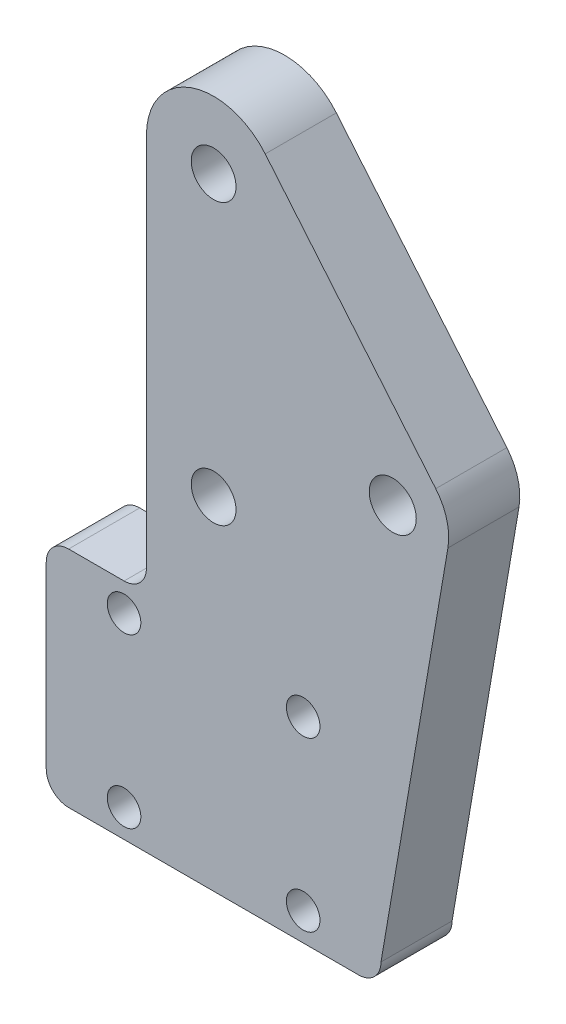
ISO-10303-21;
HEADER;
FILE_DESCRIPTION(('STEP AP214'),'2;1');
FILE_NAME('part.step','',(''),(''),'','','');
FILE_SCHEMA(('AUTOMOTIVE_DESIGN { 1 0 10303 214 1 1 1 1 }'));
ENDSEC;
DATA;
#1=APPLICATION_CONTEXT('core data for automotive mechanical design processes');
#2=APPLICATION_PROTOCOL_DEFINITION('international standard','automotive_design',2000,#1);
#3=PRODUCT_CONTEXT('',#1,'mechanical');
#4=PRODUCT('Part','Part','',(#3));
#5=PRODUCT_RELATED_PRODUCT_CATEGORY('part','',(#4));
#6=PRODUCT_DEFINITION_FORMATION('','',#4);
#7=PRODUCT_DEFINITION_CONTEXT('part definition',#1,'design');
#8=PRODUCT_DEFINITION('design','',#6,#7);
#9=PRODUCT_DEFINITION_SHAPE('','',#8);
#10=(LENGTH_UNIT() NAMED_UNIT(*) SI_UNIT(.MILLI.,.METRE.));
#11=(NAMED_UNIT(*) PLANE_ANGLE_UNIT() SI_UNIT($,.RADIAN.));
#12=(NAMED_UNIT(*) SI_UNIT($,.STERADIAN.) SOLID_ANGLE_UNIT());
#13=UNCERTAINTY_MEASURE_WITH_UNIT(LENGTH_MEASURE(1.E-05),#10,'distance_accuracy_value','');
#14=(GEOMETRIC_REPRESENTATION_CONTEXT(3) GLOBAL_UNCERTAINTY_ASSIGNED_CONTEXT((#13)) GLOBAL_UNIT_ASSIGNED_CONTEXT((#10,
#11,#12)) REPRESENTATION_CONTEXT('',''));
#15=CARTESIAN_POINT('',(0.,0.,0.));
#16=DIRECTION('',(0.,0.,1.));
#17=DIRECTION('',(1.,0.,0.));
#18=AXIS2_PLACEMENT_3D('',#15,#16,#17);
#19=CARTESIAN_POINT('',(19.9500000000002,45.4999959998346,6.35));
#20=DIRECTION('',(0.,0.,1.));
#21=DIRECTION('',(1.,0.,0.));
#22=AXIS2_PLACEMENT_3D('',#19,#20,#21);
#23=PLANE('',#22);
#24=DIRECTION('',(-0.640142111431928,0.768256517819063,0.));
#25=VECTOR('',#24,1.);
#26=CARTESIAN_POINT('',(24.5595391069245,49.3408486684344,6.35));
#27=LINE('',#26,#25);
#28=CARTESIAN_POINT('',(39.7912825890956,31.0607105569921,6.35));
#29=VERTEX_POINT('',#28);
#30=CARTESIAN_POINT('',(24.5595391069245,49.3408486684344,6.35));
#31=VERTEX_POINT('',#30);
#32=EDGE_CURVE('E131',#29,#31,#27,.T.);
#33=ORIENTED_EDGE('',*,*,#32,.T.);
#34=CARTESIAN_POINT('',(19.9500000000002,45.4999959998346,6.35));
#35=DIRECTION('',(0.,0.,1.));
#36=DIRECTION('',(1.,0.,0.));
#37=AXIS2_PLACEMENT_3D('',#34,#35,#36);
#38=CIRCLE('',#37,6.00000000001292);
#39=CARTESIAN_POINT('',(13.9499999999898,45.4999959998347,6.35));
#40=VERTEX_POINT('',#39);
#41=EDGE_CURVE('E48',#31,#40,#38,.T.);
#42=ORIENTED_EDGE('',*,*,#41,.T.);
#43=DIRECTION('',(0.,-1.,0.));
#44=VECTOR('',#43,1.);
#45=CARTESIAN_POINT('',(13.9499999999898,45.4999959998347,6.35));
#46=LINE('',#45,#44);
#47=CARTESIAN_POINT('',(13.949999999989,11.9999959998324,6.35));
#48=VERTEX_POINT('',#47);
#49=EDGE_CURVE('E203',#40,#48,#46,.T.);
#50=ORIENTED_EDGE('',*,*,#49,.T.);
#51=CARTESIAN_POINT('',(11.949999999989,11.9999959998325,6.35));
#52=DIRECTION('',(0.,0.,1.));
#53=DIRECTION('',(1.,0.,0.));
#54=AXIS2_PLACEMENT_3D('',#51,#52,#53);
#55=CIRCLE('',#54,2.);
#56=CARTESIAN_POINT('',(11.949999999989,9.99999599983247,6.35));
#57=VERTEX_POINT('',#56);
#58=EDGE_CURVE('E11',#48,#57,#55,.F.);
#59=ORIENTED_EDGE('',*,*,#58,.T.);
#60=DIRECTION('',(-1.,0.,0.));
#61=VECTOR('',#60,1.);
#62=CARTESIAN_POINT('',(5.00000000000025,9.99999599983247,6.35));
#63=LINE('',#62,#61);
#64=CARTESIAN_POINT('',(7.00000000000025,9.99999599983247,6.35));
#65=VERTEX_POINT('',#64);
#66=EDGE_CURVE('E206',#57,#65,#63,.T.);
#67=ORIENTED_EDGE('',*,*,#66,.T.);
#68=CARTESIAN_POINT('',(7.00000000000025,7.99999599983246,6.35));
#69=DIRECTION('',(0.,0.,1.));
#70=DIRECTION('',(1.,0.,0.));
#71=AXIS2_PLACEMENT_3D('',#68,#69,#70);
#72=CIRCLE('',#71,2.);
#73=CARTESIAN_POINT('',(5.00000000000025,7.99999599983246,6.35));
#74=VERTEX_POINT('',#73);
#75=EDGE_CURVE('E232',#65,#74,#72,.T.);
#76=ORIENTED_EDGE('',*,*,#75,.T.);
#77=DIRECTION('',(0.,-1.,0.));
#78=VECTOR('',#77,1.);
#79=CARTESIAN_POINT('',(5.00000000000025,-10.0000000001675,6.35));
#80=LINE('',#79,#78);
#81=CARTESIAN_POINT('',(5.00000000000025,-8.00000000016753,6.35));
#82=VERTEX_POINT('',#81);
#83=EDGE_CURVE('E196',#74,#82,#80,.T.);
#84=ORIENTED_EDGE('',*,*,#83,.T.);
#85=CARTESIAN_POINT('',(7.00000000000025,-8.00000000016753,6.35));
#86=DIRECTION('',(0.,0.,1.));
#87=DIRECTION('',(1.,0.,0.));
#88=AXIS2_PLACEMENT_3D('',#85,#86,#87);
#89=CIRCLE('',#88,2.);
#90=CARTESIAN_POINT('',(7.00000000000025,-10.0000000001675,6.35));
#91=VERTEX_POINT('',#90);
#92=EDGE_CURVE('E234',#82,#91,#89,.T.);
#93=ORIENTED_EDGE('',*,*,#92,.T.);
#94=DIRECTION('',(1.,0.,0.));
#95=VECTOR('',#94,1.);
#96=CARTESIAN_POINT('',(34.9000000000003,-10.0000000001675,6.35));
#97=LINE('',#96,#95);
#98=CARTESIAN_POINT('',(32.9000000000003,-10.0000000001675,6.35));
#99=VERTEX_POINT('',#98);
#100=EDGE_CURVE('E199',#91,#99,#97,.T.);
#101=ORIENTED_EDGE('',*,*,#100,.T.);
#102=CARTESIAN_POINT('',(32.9000000000003,-8.00000000016753,6.35));
#103=DIRECTION('',(0.,0.,1.));
#104=DIRECTION('',(1.,0.,0.));
#105=AXIS2_PLACEMENT_3D('',#102,#103,#104);
#106=CIRCLE('',#105,2.);
#107=CARTESIAN_POINT('',(34.9000000000003,-8.00000000016753,6.35));
#108=VERTEX_POINT('',#107);
#109=EDGE_CURVE('E144',#99,#108,#106,.T.);
#110=ORIENTED_EDGE('',*,*,#109,.T.);
#111=DIRECTION('',(0.168294023538244,0.985736841982336,0.));
#112=VECTOR('',#111,1.);
#113=CARTESIAN_POINT('',(34.9000000000003,-8.00000000016753,6.35));
#114=LINE('',#113,#112);
#115=CARTESIAN_POINT('',(40.8786842099119,27.0185298821413,6.35));
#116=VERTEX_POINT('',#115);
#117=EDGE_CURVE('E125',#108,#116,#114,.T.);
#118=ORIENTED_EDGE('',*,*,#117,.T.);
#119=CARTESIAN_POINT('',(35.9500000000002,27.8599999998325,6.35));
#120=DIRECTION('',(0.,0.,1.));
#121=DIRECTION('',(1.,0.,0.));
#122=AXIS2_PLACEMENT_3D('',#119,#120,#121);
#123=CIRCLE('',#122,5.);
#124=EDGE_CURVE('E134',#116,#29,#123,.T.);
#125=ORIENTED_EDGE('',*,*,#124,.T.);
#126=EDGE_LOOP('',(#33,#42,#50,#59,#67,#76,#84,#93,#101,#110,#118,#125));
#127=FACE_BOUND('',#126,.T.);
#128=CARTESIAN_POINT('',(19.9500000000002,45.4999959998346,6.35));
#129=DIRECTION('',(0.,0.,1.));
#130=DIRECTION('',(1.,0.,0.));
#131=AXIS2_PLACEMENT_3D('',#128,#129,#130);
#132=CIRCLE('',#131,1.99999999999992);
#133=CARTESIAN_POINT('',(21.9500000000002,45.4999959998346,6.35));
#134=VERTEX_POINT('',#133);
#135=EDGE_CURVE('E166',#134,#134,#132,.T.);
#136=ORIENTED_EDGE('',*,*,#135,.F.);
#137=EDGE_LOOP('',(#136));
#138=FACE_BOUND('',#137,.T.);
#139=CARTESIAN_POINT('',(27.9500000000002,7.49999999983247,6.35));
#140=DIRECTION('',(0.,0.,1.));
#141=DIRECTION('',(1.,0.,0.));
#142=AXIS2_PLACEMENT_3D('',#139,#140,#141);
#143=CIRCLE('',#142,1.50000000004549);
#144=CARTESIAN_POINT('',(29.4500000000457,7.49999999983247,6.35));
#145=VERTEX_POINT('',#144);
#146=EDGE_CURVE('E178',#145,#145,#143,.T.);
#147=ORIENTED_EDGE('',*,*,#146,.F.);
#148=EDGE_LOOP('',(#147));
#149=FACE_BOUND('',#148,.T.);
#150=CARTESIAN_POINT('',(27.9500000000002,-7.50000000016753,6.35));
#151=DIRECTION('',(0.,0.,1.));
#152=DIRECTION('',(1.,0.,0.));
#153=AXIS2_PLACEMENT_3D('',#150,#151,#152);
#154=CIRCLE('',#153,1.50000000004549);
#155=CARTESIAN_POINT('',(29.4500000000457,-7.50000000016753,6.35));
#156=VERTEX_POINT('',#155);
#157=EDGE_CURVE('E190',#156,#156,#154,.T.);
#158=ORIENTED_EDGE('',*,*,#157,.F.);
#159=EDGE_LOOP('',(#158));
#160=FACE_BOUND('',#159,.T.);
#161=CARTESIAN_POINT('',(11.9500000000002,-7.50000000016753,6.35));
#162=DIRECTION('',(0.,0.,1.));
#163=DIRECTION('',(1.,0.,0.));
#164=AXIS2_PLACEMENT_3D('',#161,#162,#163);
#165=CIRCLE('',#164,1.5000000000082);
#166=CARTESIAN_POINT('',(13.4500000000084,-7.50000000016753,6.35));
#167=VERTEX_POINT('',#166);
#168=EDGE_CURVE('E184',#167,#167,#165,.T.);
#169=ORIENTED_EDGE('',*,*,#168,.F.);
#170=EDGE_LOOP('',(#169));
#171=FACE_BOUND('',#170,.T.);
#172=CARTESIAN_POINT('',(11.9500000000002,7.49999999983247,6.35));
#173=DIRECTION('',(0.,0.,1.));
#174=DIRECTION('',(1.,0.,0.));
#175=AXIS2_PLACEMENT_3D('',#172,#173,#174);
#176=CIRCLE('',#175,1.5000000000082);
#177=CARTESIAN_POINT('',(13.4500000000084,7.49999999983247,6.35));
#178=VERTEX_POINT('',#177);
#179=EDGE_CURVE('E172',#178,#178,#176,.T.);
#180=ORIENTED_EDGE('',*,*,#179,.F.);
#181=EDGE_LOOP('',(#180));
#182=FACE_BOUND('',#181,.T.);
#183=CARTESIAN_POINT('',(19.9500000000002,20.4999959998346,6.35));
#184=DIRECTION('',(0.,0.,1.));
#185=DIRECTION('',(1.,0.,0.));
#186=AXIS2_PLACEMENT_3D('',#183,#184,#185);
#187=CIRCLE('',#186,1.99999999999992);
#188=CARTESIAN_POINT('',(21.9500000000001,20.4999959998346,6.35));
#189=VERTEX_POINT('',#188);
#190=EDGE_CURVE('E160',#189,#189,#187,.T.);
#191=ORIENTED_EDGE('',*,*,#190,.F.);
#192=EDGE_LOOP('',(#191));
#193=FACE_BOUND('',#192,.T.);
#194=CARTESIAN_POINT('',(35.9500000000002,27.8599999998325,6.35));
#195=DIRECTION('',(0.,0.,1.));
#196=DIRECTION('',(1.,0.,0.));
#197=AXIS2_PLACEMENT_3D('',#194,#195,#196);
#198=CIRCLE('',#197,2.1);
#199=CARTESIAN_POINT('',(38.0500000000002,27.8599999998325,6.35));
#200=VERTEX_POINT('',#199);
#201=EDGE_CURVE('E146',#200,#200,#198,.T.);
#202=ORIENTED_EDGE('',*,*,#201,.F.);
#203=EDGE_LOOP('',(#202));
#204=FACE_BOUND('',#203,.T.);
#205=ADVANCED_FACE('F33',(#127,#138,#149,#160,#171,#182,#193,#204),#23,.T.);
#206=CARTESIAN_POINT('',(19.9500000000002,45.4999959998346,0.));
#207=DIRECTION('',(0.,0.,1.));
#208=DIRECTION('',(1.,0.,0.));
#209=AXIS2_PLACEMENT_3D('',#206,#207,#208);
#210=PLANE('',#209);
#211=CARTESIAN_POINT('',(19.9500000000002,45.4999959998346,0.));
#212=DIRECTION('',(0.,0.,1.));
#213=DIRECTION('',(1.,0.,0.));
#214=AXIS2_PLACEMENT_3D('',#211,#212,#213);
#215=CIRCLE('',#214,6.00000000001292);
#216=CARTESIAN_POINT('',(24.5595391069245,49.3408486684344,0.));
#217=VERTEX_POINT('',#216);
#218=CARTESIAN_POINT('',(13.9499999999898,45.4999959998347,0.));
#219=VERTEX_POINT('',#218);
#220=EDGE_CURVE('E215',#217,#219,#215,.T.);
#221=ORIENTED_EDGE('',*,*,#220,.F.);
#222=DIRECTION('',(0.640142111431928,-0.768256517819063,0.));
#223=VECTOR('',#222,1.);
#224=CARTESIAN_POINT('',(24.5595391069245,49.3408486684344,0.));
#225=LINE('',#224,#223);
#226=CARTESIAN_POINT('',(39.7912825890956,31.0607105569921,0.));
#227=VERTEX_POINT('',#226);
#228=EDGE_CURVE('E159',#217,#227,#225,.T.);
#229=ORIENTED_EDGE('',*,*,#228,.T.);
#230=CARTESIAN_POINT('',(35.9500000000002,27.8599999998325,0.));
#231=DIRECTION('',(0.,0.,1.));
#232=DIRECTION('',(1.,0.,0.));
#233=AXIS2_PLACEMENT_3D('',#230,#231,#232);
#234=CIRCLE('',#233,5.);
#235=CARTESIAN_POINT('',(40.8786842099119,27.0185298821413,0.));
#236=VERTEX_POINT('',#235);
#237=EDGE_CURVE('E289',#227,#236,#234,.F.);
#238=ORIENTED_EDGE('',*,*,#237,.T.);
#239=DIRECTION('',(-0.168294023538244,-0.985736841982336,0.));
#240=VECTOR('',#239,1.);
#241=CARTESIAN_POINT('',(34.9000000000003,-8.00000000016753,0.));
#242=LINE('',#241,#240);
#243=CARTESIAN_POINT('',(34.9000000000003,-8.00000000016753,0.));
#244=VERTEX_POINT('',#243);
#245=EDGE_CURVE('E127',#236,#244,#242,.T.);
#246=ORIENTED_EDGE('',*,*,#245,.T.);
#247=CARTESIAN_POINT('',(32.9000000000003,-8.00000000016753,0.));
#248=DIRECTION('',(0.,0.,1.));
#249=DIRECTION('',(1.,0.,0.));
#250=AXIS2_PLACEMENT_3D('',#247,#248,#249);
#251=CIRCLE('',#250,2.);
#252=CARTESIAN_POINT('',(32.9000000000003,-10.0000000001675,0.));
#253=VERTEX_POINT('',#252);
#254=EDGE_CURVE('E228',#244,#253,#251,.F.);
#255=ORIENTED_EDGE('',*,*,#254,.T.);
#256=DIRECTION('',(1.,0.,0.));
#257=VECTOR('',#256,1.);
#258=CARTESIAN_POINT('',(34.9000000000003,-10.0000000001675,0.));
#259=LINE('',#258,#257);
#260=CARTESIAN_POINT('',(7.00000000000025,-10.0000000001675,0.));
#261=VERTEX_POINT('',#260);
#262=EDGE_CURVE('E212',#261,#253,#259,.T.);
#263=ORIENTED_EDGE('',*,*,#262,.F.);
#264=CARTESIAN_POINT('',(7.00000000000025,-8.00000000016753,0.));
#265=DIRECTION('',(0.,0.,1.));
#266=DIRECTION('',(1.,0.,0.));
#267=AXIS2_PLACEMENT_3D('',#264,#265,#266);
#268=CIRCLE('',#267,2.);
#269=CARTESIAN_POINT('',(5.00000000000025,-8.00000000016753,0.));
#270=VERTEX_POINT('',#269);
#271=EDGE_CURVE('E226',#261,#270,#268,.F.);
#272=ORIENTED_EDGE('',*,*,#271,.T.);
#273=DIRECTION('',(0.,-1.,0.));
#274=VECTOR('',#273,1.);
#275=CARTESIAN_POINT('',(5.00000000000025,-10.0000000001675,0.));
#276=LINE('',#275,#274);
#277=CARTESIAN_POINT('',(5.00000000000025,7.99999599983246,0.));
#278=VERTEX_POINT('',#277);
#279=EDGE_CURVE('E193',#278,#270,#276,.T.);
#280=ORIENTED_EDGE('',*,*,#279,.F.);
#281=CARTESIAN_POINT('',(7.00000000000025,7.99999599983246,0.));
#282=DIRECTION('',(0.,0.,1.));
#283=DIRECTION('',(1.,0.,0.));
#284=AXIS2_PLACEMENT_3D('',#281,#282,#283);
#285=CIRCLE('',#284,2.);
#286=CARTESIAN_POINT('',(7.00000000000025,9.99999599983247,0.));
#287=VERTEX_POINT('',#286);
#288=EDGE_CURVE('E224',#278,#287,#285,.F.);
#289=ORIENTED_EDGE('',*,*,#288,.T.);
#290=DIRECTION('',(-1.,0.,0.));
#291=VECTOR('',#290,1.);
#292=CARTESIAN_POINT('',(5.00000000000025,9.99999599983247,0.));
#293=LINE('',#292,#291);
#294=CARTESIAN_POINT('',(11.949999999989,9.99999599983247,0.));
#295=VERTEX_POINT('',#294);
#296=EDGE_CURVE('E200',#295,#287,#293,.T.);
#297=ORIENTED_EDGE('',*,*,#296,.F.);
#298=CARTESIAN_POINT('',(11.949999999989,11.9999959998325,0.));
#299=DIRECTION('',(0.,0.,1.));
#300=DIRECTION('',(1.,0.,0.));
#301=AXIS2_PLACEMENT_3D('',#298,#299,#300);
#302=CIRCLE('',#301,2.);
#303=CARTESIAN_POINT('',(13.949999999989,11.9999959998324,0.));
#304=VERTEX_POINT('',#303);
#305=EDGE_CURVE('E41',#295,#304,#302,.T.);
#306=ORIENTED_EDGE('',*,*,#305,.T.);
#307=DIRECTION('',(0.,-1.,0.));
#308=VECTOR('',#307,1.);
#309=CARTESIAN_POINT('',(13.9499999999898,45.4999959998347,0.));
#310=LINE('',#309,#308);
#311=EDGE_CURVE('E217',#219,#304,#310,.T.);
#312=ORIENTED_EDGE('',*,*,#311,.F.);
#313=EDGE_LOOP('',(#221,#229,#238,#246,#255,#263,#272,#280,#289,#297,#306,#312));
#314=FACE_BOUND('',#313,.T.);
#315=CARTESIAN_POINT('',(27.9500000000002,-7.50000000016753,0.));
#316=DIRECTION('',(0.,0.,1.));
#317=DIRECTION('',(1.,0.,0.));
#318=AXIS2_PLACEMENT_3D('',#315,#316,#317);
#319=CIRCLE('',#318,1.50000000004549);
#320=CARTESIAN_POINT('',(29.4500000000457,-7.50000000016753,0.));
#321=VERTEX_POINT('',#320);
#322=EDGE_CURVE('E187',#321,#321,#319,.T.);
#323=ORIENTED_EDGE('',*,*,#322,.T.);
#324=EDGE_LOOP('',(#323));
#325=FACE_BOUND('',#324,.T.);
#326=CARTESIAN_POINT('',(11.9500000000002,-7.50000000016753,0.));
#327=DIRECTION('',(0.,0.,1.));
#328=DIRECTION('',(1.,0.,0.));
#329=AXIS2_PLACEMENT_3D('',#326,#327,#328);
#330=CIRCLE('',#329,1.5000000000082);
#331=CARTESIAN_POINT('',(13.4500000000084,-7.50000000016753,0.));
#332=VERTEX_POINT('',#331);
#333=EDGE_CURVE('E181',#332,#332,#330,.T.);
#334=ORIENTED_EDGE('',*,*,#333,.T.);
#335=EDGE_LOOP('',(#334));
#336=FACE_BOUND('',#335,.T.);
#337=CARTESIAN_POINT('',(27.9500000000002,7.49999999983247,0.));
#338=DIRECTION('',(0.,0.,1.));
#339=DIRECTION('',(1.,0.,0.));
#340=AXIS2_PLACEMENT_3D('',#337,#338,#339);
#341=CIRCLE('',#340,1.50000000004549);
#342=CARTESIAN_POINT('',(29.4500000000457,7.49999999983247,0.));
#343=VERTEX_POINT('',#342);
#344=EDGE_CURVE('E175',#343,#343,#341,.T.);
#345=ORIENTED_EDGE('',*,*,#344,.T.);
#346=EDGE_LOOP('',(#345));
#347=FACE_BOUND('',#346,.T.);
#348=CARTESIAN_POINT('',(11.9500000000002,7.49999999983247,0.));
#349=DIRECTION('',(0.,0.,1.));
#350=DIRECTION('',(1.,0.,0.));
#351=AXIS2_PLACEMENT_3D('',#348,#349,#350);
#352=CIRCLE('',#351,1.5000000000082);
#353=CARTESIAN_POINT('',(13.4500000000084,7.49999999983247,0.));
#354=VERTEX_POINT('',#353);
#355=EDGE_CURVE('E169',#354,#354,#352,.T.);
#356=ORIENTED_EDGE('',*,*,#355,.T.);
#357=EDGE_LOOP('',(#356));
#358=FACE_BOUND('',#357,.T.);
#359=CARTESIAN_POINT('',(19.9500000000002,45.4999959998346,0.));
#360=DIRECTION('',(0.,0.,1.));
#361=DIRECTION('',(1.,0.,0.));
#362=AXIS2_PLACEMENT_3D('',#359,#360,#361);
#363=CIRCLE('',#362,1.99999999999992);
#364=CARTESIAN_POINT('',(21.9500000000002,45.4999959998346,0.));
#365=VERTEX_POINT('',#364);
#366=EDGE_CURVE('E163',#365,#365,#363,.T.);
#367=ORIENTED_EDGE('',*,*,#366,.T.);
#368=EDGE_LOOP('',(#367));
#369=FACE_BOUND('',#368,.T.);
#370=CARTESIAN_POINT('',(19.9500000000002,20.4999959998346,0.));
#371=DIRECTION('',(0.,0.,1.));
#372=DIRECTION('',(1.,0.,0.));
#373=AXIS2_PLACEMENT_3D('',#370,#371,#372);
#374=CIRCLE('',#373,1.99999999999992);
#375=CARTESIAN_POINT('',(21.9500000000001,20.4999959998346,0.));
#376=VERTEX_POINT('',#375);
#377=EDGE_CURVE('E158',#376,#376,#374,.T.);
#378=ORIENTED_EDGE('',*,*,#377,.T.);
#379=EDGE_LOOP('',(#378));
#380=FACE_BOUND('',#379,.T.);
#381=CARTESIAN_POINT('',(35.9500000000002,27.8599999998325,0.));
#382=DIRECTION('',(0.,0.,1.));
#383=DIRECTION('',(1.,0.,0.));
#384=AXIS2_PLACEMENT_3D('',#381,#382,#383);
#385=CIRCLE('',#384,2.1);
#386=CARTESIAN_POINT('',(38.0500000000002,27.8599999998325,0.));
#387=VERTEX_POINT('',#386);
#388=EDGE_CURVE('E155',#387,#387,#385,.F.);
#389=ORIENTED_EDGE('',*,*,#388,.F.);
#390=EDGE_LOOP('',(#389));
#391=FACE_BOUND('',#390,.T.);
#392=ADVANCED_FACE('F256',(#314,#325,#336,#347,#358,#369,#380,#391),#210,.F.);
#393=CARTESIAN_POINT('',(5.00000000000025,-10.0000000001675,6.35));
#394=DIRECTION('',(1.,0.,0.));
#395=DIRECTION('',(0.,0.,-1.));
#396=AXIS2_PLACEMENT_3D('',#393,#394,#395);
#397=PLANE('',#396);
#398=ORIENTED_EDGE('',*,*,#279,.T.);
#399=DIRECTION('',(0.,0.,-1.));
#400=VECTOR('',#399,1.);
#401=CARTESIAN_POINT('',(5.00000000000025,-8.00000000016753,6.35));
#402=LINE('',#401,#400);
#403=EDGE_CURVE('E245',#270,#82,#402,.F.);
#404=ORIENTED_EDGE('',*,*,#403,.T.);
#405=ORIENTED_EDGE('',*,*,#83,.F.);
#406=DIRECTION('',(0.,0.,-1.));
#407=VECTOR('',#406,1.);
#408=CARTESIAN_POINT('',(5.00000000000025,7.99999599983246,6.35));
#409=LINE('',#408,#407);
#410=EDGE_CURVE('E242',#74,#278,#409,.T.);
#411=ORIENTED_EDGE('',*,*,#410,.T.);
#412=EDGE_LOOP('',(#398,#404,#405,#411));
#413=FACE_BOUND('',#412,.T.);
#414=ADVANCED_FACE('F276',(#413),#397,.F.);
#415=CARTESIAN_POINT('',(34.9000000000003,-10.0000000001675,6.35));
#416=DIRECTION('',(0.,1.,0.));
#417=DIRECTION('',(0.,0.,1.));
#418=AXIS2_PLACEMENT_3D('',#415,#416,#417);
#419=PLANE('',#418);
#420=ORIENTED_EDGE('',*,*,#262,.T.);
#421=DIRECTION('',(0.,0.,-1.));
#422=VECTOR('',#421,1.);
#423=CARTESIAN_POINT('',(32.9000000000003,-10.0000000001675,6.35));
#424=LINE('',#423,#422);
#425=EDGE_CURVE('E240',#253,#99,#424,.F.);
#426=ORIENTED_EDGE('',*,*,#425,.T.);
#427=ORIENTED_EDGE('',*,*,#100,.F.);
#428=DIRECTION('',(0.,0.,-1.));
#429=VECTOR('',#428,1.);
#430=CARTESIAN_POINT('',(7.00000000000025,-10.0000000001675,6.35));
#431=LINE('',#430,#429);
#432=EDGE_CURVE('E237',#91,#261,#431,.T.);
#433=ORIENTED_EDGE('',*,*,#432,.T.);
#434=EDGE_LOOP('',(#420,#426,#427,#433));
#435=FACE_BOUND('',#434,.T.);
#436=ADVANCED_FACE('F284',(#435),#419,.F.);
#437=CARTESIAN_POINT('',(19.9500000000002,45.4999959998346,6.35));
#438=DIRECTION('',(0.,0.,-1.));
#439=DIRECTION('',(-1.,0.,0.));
#440=AXIS2_PLACEMENT_3D('',#437,#438,#439);
#441=CYLINDRICAL_SURFACE('',#440,6.00000000001292);
#442=ORIENTED_EDGE('',*,*,#41,.F.);
#443=DIRECTION('',(0.,0.,1.));
#444=VECTOR('',#443,1.);
#445=CARTESIAN_POINT('',(24.5595391069245,49.3408486684344,-59.63740549624));
#446=LINE('',#445,#444);
#447=EDGE_CURVE('E52',#217,#31,#446,.T.);
#448=ORIENTED_EDGE('',*,*,#447,.F.);
#449=ORIENTED_EDGE('',*,*,#220,.T.);
#450=DIRECTION('',(0.,0.,-1.));
#451=VECTOR('',#450,1.);
#452=CARTESIAN_POINT('',(13.9499999999898,45.4999959998347,6.35));
#453=LINE('',#452,#451);
#454=EDGE_CURVE('E209',#40,#219,#453,.T.);
#455=ORIENTED_EDGE('',*,*,#454,.F.);
#456=EDGE_LOOP('',(#442,#448,#449,#455));
#457=FACE_BOUND('',#456,.T.);
#458=ADVANCED_FACE('F295',(#457),#441,.T.);
#459=CARTESIAN_POINT('',(13.9499999999898,45.4999959998347,6.35));
#460=DIRECTION('',(1.,0.,0.));
#461=DIRECTION('',(0.,1.,0.));
#462=AXIS2_PLACEMENT_3D('',#459,#460,#461);
#463=PLANE('',#462);
#464=ORIENTED_EDGE('',*,*,#311,.T.);
#465=DIRECTION('',(0.,0.,-1.));
#466=VECTOR('',#465,1.);
#467=CARTESIAN_POINT('',(13.949999999989,11.9999959998324,6.35));
#468=LINE('',#467,#466);
#469=EDGE_CURVE('E252',#304,#48,#468,.F.);
#470=ORIENTED_EDGE('',*,*,#469,.T.);
#471=ORIENTED_EDGE('',*,*,#49,.F.);
#472=ORIENTED_EDGE('',*,*,#454,.T.);
#473=EDGE_LOOP('',(#464,#470,#471,#472));
#474=FACE_BOUND('',#473,.T.);
#475=ADVANCED_FACE('F262',(#474),#463,.F.);
#476=CARTESIAN_POINT('',(5.00000000000025,9.99999599983247,6.35));
#477=DIRECTION('',(0.,-1.,0.));
#478=DIRECTION('',(0.,0.,-1.));
#479=AXIS2_PLACEMENT_3D('',#476,#477,#478);
#480=PLANE('',#479);
#481=ORIENTED_EDGE('',*,*,#296,.T.);
#482=DIRECTION('',(0.,0.,-1.));
#483=VECTOR('',#482,1.);
#484=CARTESIAN_POINT('',(7.00000000000025,9.99999599983247,6.35));
#485=LINE('',#484,#483);
#486=EDGE_CURVE('E250',#287,#65,#485,.F.);
#487=ORIENTED_EDGE('',*,*,#486,.T.);
#488=ORIENTED_EDGE('',*,*,#66,.F.);
#489=DIRECTION('',(0.,0.,-1.));
#490=VECTOR('',#489,1.);
#491=CARTESIAN_POINT('',(11.949999999989,9.99999599983247,0.));
#492=LINE('',#491,#490);
#493=EDGE_CURVE('E247',#57,#295,#492,.T.);
#494=ORIENTED_EDGE('',*,*,#493,.T.);
#495=EDGE_LOOP('',(#481,#487,#488,#494));
#496=FACE_BOUND('',#495,.T.);
#497=ADVANCED_FACE('F268',(#496),#480,.F.);
#498=CARTESIAN_POINT('',(27.9500000000002,-7.50000000016753,6.35));
#499=DIRECTION('',(0.,0.,-1.));
#500=DIRECTION('',(-1.,0.,0.));
#501=AXIS2_PLACEMENT_3D('',#498,#499,#500);
#502=CYLINDRICAL_SURFACE('',#501,1.50000000004549);
#503=ORIENTED_EDGE('',*,*,#157,.T.);
#504=EDGE_LOOP('',(#503));
#505=FACE_BOUND('',#504,.T.);
#506=ORIENTED_EDGE('',*,*,#322,.F.);
#507=EDGE_LOOP('',(#506));
#508=FACE_BOUND('',#507,.T.);
#509=ADVANCED_FACE('F311',(#505,#508),#502,.F.);
#510=CARTESIAN_POINT('',(11.9500000000002,-7.50000000016753,6.35));
#511=DIRECTION('',(0.,0.,-1.));
#512=DIRECTION('',(-1.,0.,0.));
#513=AXIS2_PLACEMENT_3D('',#510,#511,#512);
#514=CYLINDRICAL_SURFACE('',#513,1.5000000000082);
#515=ORIENTED_EDGE('',*,*,#168,.T.);
#516=EDGE_LOOP('',(#515));
#517=FACE_BOUND('',#516,.T.);
#518=ORIENTED_EDGE('',*,*,#333,.F.);
#519=EDGE_LOOP('',(#518));
#520=FACE_BOUND('',#519,.T.);
#521=ADVANCED_FACE('F318',(#517,#520),#514,.F.);
#522=CARTESIAN_POINT('',(27.9500000000002,7.49999999983247,6.35));
#523=DIRECTION('',(0.,0.,-1.));
#524=DIRECTION('',(-1.,0.,0.));
#525=AXIS2_PLACEMENT_3D('',#522,#523,#524);
#526=CYLINDRICAL_SURFACE('',#525,1.50000000004549);
#527=ORIENTED_EDGE('',*,*,#146,.T.);
#528=EDGE_LOOP('',(#527));
#529=FACE_BOUND('',#528,.T.);
#530=ORIENTED_EDGE('',*,*,#344,.F.);
#531=EDGE_LOOP('',(#530));
#532=FACE_BOUND('',#531,.T.);
#533=ADVANCED_FACE('F323',(#529,#532),#526,.F.);
#534=CARTESIAN_POINT('',(11.9500000000002,7.49999999983247,6.35));
#535=DIRECTION('',(0.,0.,-1.));
#536=DIRECTION('',(-1.,0.,0.));
#537=AXIS2_PLACEMENT_3D('',#534,#535,#536);
#538=CYLINDRICAL_SURFACE('',#537,1.5000000000082);
#539=ORIENTED_EDGE('',*,*,#179,.T.);
#540=EDGE_LOOP('',(#539));
#541=FACE_BOUND('',#540,.T.);
#542=ORIENTED_EDGE('',*,*,#355,.F.);
#543=EDGE_LOOP('',(#542));
#544=FACE_BOUND('',#543,.T.);
#545=ADVANCED_FACE('F363',(#541,#544),#538,.F.);
#546=CARTESIAN_POINT('',(19.9500000000002,45.4999959998346,6.35));
#547=DIRECTION('',(0.,0.,-1.));
#548=DIRECTION('',(-1.,0.,0.));
#549=AXIS2_PLACEMENT_3D('',#546,#547,#548);
#550=CYLINDRICAL_SURFACE('',#549,1.99999999999992);
#551=ORIENTED_EDGE('',*,*,#135,.T.);
#552=EDGE_LOOP('',(#551));
#553=FACE_BOUND('',#552,.T.);
#554=ORIENTED_EDGE('',*,*,#366,.F.);
#555=EDGE_LOOP('',(#554));
#556=FACE_BOUND('',#555,.T.);
#557=ADVANCED_FACE('F359',(#553,#556),#550,.F.);
#558=CARTESIAN_POINT('',(19.9500000000002,20.4999959998346,6.35));
#559=DIRECTION('',(0.,0.,-1.));
#560=DIRECTION('',(-1.,0.,0.));
#561=AXIS2_PLACEMENT_3D('',#558,#559,#560);
#562=CYLINDRICAL_SURFACE('',#561,1.99999999999992);
#563=ORIENTED_EDGE('',*,*,#190,.T.);
#564=EDGE_LOOP('',(#563));
#565=FACE_BOUND('',#564,.T.);
#566=ORIENTED_EDGE('',*,*,#377,.F.);
#567=EDGE_LOOP('',(#566));
#568=FACE_BOUND('',#567,.T.);
#569=ADVANCED_FACE('F356',(#565,#568),#562,.F.);
#570=CARTESIAN_POINT('',(32.9000000000003,-8.00000000016753,6.35));
#571=DIRECTION('',(0.,0.,-1.));
#572=DIRECTION('',(-1.,0.,0.));
#573=AXIS2_PLACEMENT_3D('',#570,#571,#572);
#574=CYLINDRICAL_SURFACE('',#573,2.);
#575=ORIENTED_EDGE('',*,*,#109,.F.);
#576=ORIENTED_EDGE('',*,*,#425,.F.);
#577=ORIENTED_EDGE('',*,*,#254,.F.);
#578=DIRECTION('',(0.,0.,-1.));
#579=VECTOR('',#578,1.);
#580=CARTESIAN_POINT('',(34.9000000000003,-8.00000000016753,6.35));
#581=LINE('',#580,#579);
#582=EDGE_CURVE('E230',#108,#244,#581,.T.);
#583=ORIENTED_EDGE('',*,*,#582,.F.);
#584=EDGE_LOOP('',(#575,#576,#577,#583));
#585=FACE_BOUND('',#584,.T.);
#586=ADVANCED_FACE('F288',(#585),#574,.T.);
#587=CARTESIAN_POINT('',(7.00000000000025,-8.00000000016753,6.35));
#588=DIRECTION('',(0.,0.,-1.));
#589=DIRECTION('',(-1.,0.,0.));
#590=AXIS2_PLACEMENT_3D('',#587,#588,#589);
#591=CYLINDRICAL_SURFACE('',#590,2.);
#592=ORIENTED_EDGE('',*,*,#92,.F.);
#593=ORIENTED_EDGE('',*,*,#403,.F.);
#594=ORIENTED_EDGE('',*,*,#271,.F.);
#595=ORIENTED_EDGE('',*,*,#432,.F.);
#596=EDGE_LOOP('',(#592,#593,#594,#595));
#597=FACE_BOUND('',#596,.T.);
#598=ADVANCED_FACE('F280',(#597),#591,.T.);
#599=CARTESIAN_POINT('',(7.00000000000025,7.99999599983246,6.35));
#600=DIRECTION('',(0.,0.,-1.));
#601=DIRECTION('',(-1.,0.,0.));
#602=AXIS2_PLACEMENT_3D('',#599,#600,#601);
#603=CYLINDRICAL_SURFACE('',#602,2.);
#604=ORIENTED_EDGE('',*,*,#75,.F.);
#605=ORIENTED_EDGE('',*,*,#486,.F.);
#606=ORIENTED_EDGE('',*,*,#288,.F.);
#607=ORIENTED_EDGE('',*,*,#410,.F.);
#608=EDGE_LOOP('',(#604,#605,#606,#607));
#609=FACE_BOUND('',#608,.T.);
#610=ADVANCED_FACE('F271',(#609),#603,.T.);
#611=CARTESIAN_POINT('',(11.949999999989,11.9999959998325,6.35));
#612=DIRECTION('',(0.,0.,1.));
#613=DIRECTION('',(1.,0.,0.));
#614=AXIS2_PLACEMENT_3D('',#611,#612,#613);
#615=CYLINDRICAL_SURFACE('',#614,2.);
#616=ORIENTED_EDGE('',*,*,#58,.F.);
#617=ORIENTED_EDGE('',*,*,#469,.F.);
#618=ORIENTED_EDGE('',*,*,#305,.F.);
#619=ORIENTED_EDGE('',*,*,#493,.F.);
#620=EDGE_LOOP('',(#616,#617,#618,#619));
#621=FACE_BOUND('',#620,.T.);
#622=ADVANCED_FACE('F35',(#621),#615,.F.);
#623=CARTESIAN_POINT('',(34.9000000000003,-8.00000000016753,-59.63740549624));
#624=DIRECTION('',(0.985736841982336,-0.168294023538244,0.));
#625=DIRECTION('',(0.168294023538244,0.985736841982336,0.));
#626=AXIS2_PLACEMENT_3D('',#623,#624,#625);
#627=PLANE('',#626);
#628=ORIENTED_EDGE('',*,*,#245,.F.);
#629=DIRECTION('',(0.,0.,1.));
#630=VECTOR('',#629,1.);
#631=CARTESIAN_POINT('',(40.8786842099119,27.0185298821413,-59.63740549624));
#632=LINE('',#631,#630);
#633=EDGE_CURVE('E120',#236,#116,#632,.T.);
#634=ORIENTED_EDGE('',*,*,#633,.T.);
#635=ORIENTED_EDGE('',*,*,#117,.F.);
#636=ORIENTED_EDGE('',*,*,#582,.T.);
#637=EDGE_LOOP('',(#628,#634,#635,#636));
#638=FACE_BOUND('',#637,.T.);
#639=ADVANCED_FACE('F122',(#638),#627,.T.);
#640=CARTESIAN_POINT('',(35.9500000000002,27.8599999998325,-59.63740549624));
#641=DIRECTION('',(0.,0.,1.));
#642=DIRECTION('',(1.,0.,0.));
#643=AXIS2_PLACEMENT_3D('',#640,#641,#642);
#644=CYLINDRICAL_SURFACE('',#643,5.);
#645=ORIENTED_EDGE('',*,*,#237,.F.);
#646=DIRECTION('',(0.,0.,1.));
#647=VECTOR('',#646,1.);
#648=CARTESIAN_POINT('',(39.7912825890956,31.0607105569921,-59.63740549624));
#649=LINE('',#648,#647);
#650=EDGE_CURVE('E130',#227,#29,#649,.T.);
#651=ORIENTED_EDGE('',*,*,#650,.T.);
#652=ORIENTED_EDGE('',*,*,#124,.F.);
#653=ORIENTED_EDGE('',*,*,#633,.F.);
#654=EDGE_LOOP('',(#645,#651,#652,#653));
#655=FACE_BOUND('',#654,.T.);
#656=ADVANCED_FACE('F135',(#655),#644,.T.);
#657=CARTESIAN_POINT('',(24.5595391069245,49.3408486684344,-59.63740549624));
#658=DIRECTION('',(0.768256517819063,0.640142111431928,0.));
#659=DIRECTION('',(-0.640142111431928,0.768256517819063,0.));
#660=AXIS2_PLACEMENT_3D('',#657,#658,#659);
#661=PLANE('',#660);
#662=ORIENTED_EDGE('',*,*,#228,.F.);
#663=ORIENTED_EDGE('',*,*,#447,.T.);
#664=ORIENTED_EDGE('',*,*,#32,.F.);
#665=ORIENTED_EDGE('',*,*,#650,.F.);
#666=EDGE_LOOP('',(#662,#663,#664,#665));
#667=FACE_BOUND('',#666,.T.);
#668=ADVANCED_FACE('F294',(#667),#661,.T.);
#669=CARTESIAN_POINT('',(35.9500000000002,27.8599999998325,-59.63740549624));
#670=DIRECTION('',(0.,0.,1.));
#671=DIRECTION('',(1.,0.,0.));
#672=AXIS2_PLACEMENT_3D('',#669,#670,#671);
#673=CYLINDRICAL_SURFACE('',#672,2.1);
#674=ORIENTED_EDGE('',*,*,#388,.T.);
#675=EDGE_LOOP('',(#674));
#676=FACE_BOUND('',#675,.T.);
#677=ORIENTED_EDGE('',*,*,#201,.T.);
#678=EDGE_LOOP('',(#677));
#679=FACE_BOUND('',#678,.T.);
#680=ADVANCED_FACE('F341',(#676,#679),#673,.F.);
#681=CLOSED_SHELL('',(#205,#392,#414,#436,#458,#475,#497,#509,#521,#533,#545,#557,#569,#586,
#598,#610,#622,#639,#656,#668,#680));
#682=MANIFOLD_SOLID_BREP('B2',#681);
#683=ADVANCED_BREP_SHAPE_REPRESENTATION('',(#18,#682),#14);
#684=SHAPE_DEFINITION_REPRESENTATION(#9,#683);
ENDSEC;
END-ISO-10303-21;
